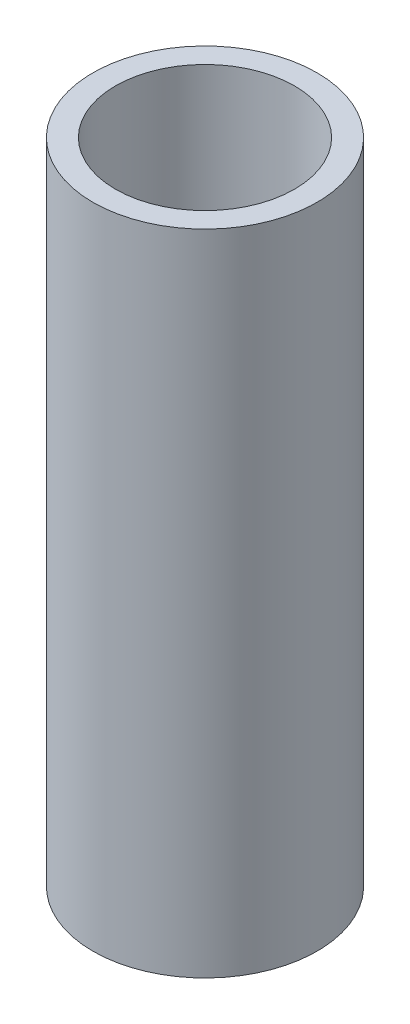
ISO-10303-21;
HEADER;
FILE_DESCRIPTION(('STEP AP214'),'2;1');
FILE_NAME('part.step','',(''),(''),'','','');
FILE_SCHEMA(('AUTOMOTIVE_DESIGN { 1 0 10303 214 1 1 1 1 }'));
ENDSEC;
DATA;
#1=APPLICATION_CONTEXT('core data for automotive mechanical design processes');
#2=APPLICATION_PROTOCOL_DEFINITION('international standard','automotive_design',2000,#1);
#3=PRODUCT_CONTEXT('',#1,'mechanical');
#4=PRODUCT('Part','Part','',(#3));
#5=PRODUCT_RELATED_PRODUCT_CATEGORY('part','',(#4));
#6=PRODUCT_DEFINITION_FORMATION('','',#4);
#7=PRODUCT_DEFINITION_CONTEXT('part definition',#1,'design');
#8=PRODUCT_DEFINITION('design','',#6,#7);
#9=PRODUCT_DEFINITION_SHAPE('','',#8);
#10=(LENGTH_UNIT() NAMED_UNIT(*) SI_UNIT(.MILLI.,.METRE.));
#11=(NAMED_UNIT(*) PLANE_ANGLE_UNIT() SI_UNIT($,.RADIAN.));
#12=(NAMED_UNIT(*) SI_UNIT($,.STERADIAN.) SOLID_ANGLE_UNIT());
#13=UNCERTAINTY_MEASURE_WITH_UNIT(LENGTH_MEASURE(1.E-05),#10,'distance_accuracy_value','');
#14=(GEOMETRIC_REPRESENTATION_CONTEXT(3) GLOBAL_UNCERTAINTY_ASSIGNED_CONTEXT((#13)) GLOBAL_UNIT_ASSIGNED_CONTEXT((#10,
#11,#12)) REPRESENTATION_CONTEXT('',''));
#15=CARTESIAN_POINT('',(0.,0.,0.));
#16=DIRECTION('',(0.,0.,1.));
#17=DIRECTION('',(1.,0.,0.));
#18=AXIS2_PLACEMENT_3D('',#15,#16,#17);
#19=CARTESIAN_POINT('',(0.,216.870746507421,0.));
#20=DIRECTION('',(0.,-1.,0.));
#21=DIRECTION('',(0.,0.,-1.));
#22=AXIS2_PLACEMENT_3D('',#19,#20,#21);
#23=CYLINDRICAL_SURFACE('',#22,37.5);
#24=CARTESIAN_POINT('',(0.,216.870746507421,0.));
#25=DIRECTION('',(0.,1.,0.));
#26=DIRECTION('',(0.,0.,1.));
#27=AXIS2_PLACEMENT_3D('',#24,#25,#26);
#28=CIRCLE('',#27,37.5);
#29=CARTESIAN_POINT('',(0.,216.870746507421,-37.5));
#30=VERTEX_POINT('',#29);
#31=EDGE_CURVE('E10',#30,#30,#28,.T.);
#32=CARTESIAN_POINT('',(0.,0.,0.));
#33=DIRECTION('',(0.,1.,0.));
#34=DIRECTION('',(0.,0.,1.));
#35=AXIS2_PLACEMENT_3D('',#32,#33,#34);
#36=CIRCLE('',#35,37.5);
#37=CARTESIAN_POINT('',(0.,0.,-37.5));
#38=VERTEX_POINT('',#37);
#39=EDGE_CURVE('E37',#38,#38,#36,.T.);
#40=CARTESIAN_POINT('',(0.,216.870746507421,-37.5));
#41=CARTESIAN_POINT('',(0.,214.611676231302,-37.5));
#42=CARTESIAN_POINT('',(0.,212.352605955183,-37.5));
#43=CARTESIAN_POINT('',(0.,207.834465402945,-37.5));
#44=CARTESIAN_POINT('',(0.,205.575395126826,-37.5));
#45=CARTESIAN_POINT('',(0.,201.057254574588,-37.5));
#46=CARTESIAN_POINT('',(0.,198.798184298469,-37.5));
#47=CARTESIAN_POINT('',(0.,194.280043746231,-37.5));
#48=CARTESIAN_POINT('',(0.,192.020973470112,-37.5));
#49=CARTESIAN_POINT('',(0.,187.502832917875,-37.5));
#50=CARTESIAN_POINT('',(0.,185.243762641756,-37.5));
#51=CARTESIAN_POINT('',(0.,180.725622089518,-37.5));
#52=CARTESIAN_POINT('',(0.,178.466551813399,-37.5));
#53=CARTESIAN_POINT('',(0.,173.948411261161,-37.5));
#54=CARTESIAN_POINT('',(0.,171.689340985042,-37.5));
#55=CARTESIAN_POINT('',(0.,167.171200432804,-37.5));
#56=CARTESIAN_POINT('',(0.,164.912130156685,-37.5));
#57=CARTESIAN_POINT('',(0.,160.393989604447,-37.5));
#58=CARTESIAN_POINT('',(0.,158.134919328328,-37.5));
#59=CARTESIAN_POINT('',(0.,153.61677877609,-37.5));
#60=CARTESIAN_POINT('',(0.,151.357708499971,-37.5));
#61=CARTESIAN_POINT('',(0.,146.839567947733,-37.5));
#62=CARTESIAN_POINT('',(0.,144.580497671614,-37.5));
#63=CARTESIAN_POINT('',(0.,140.062357119376,-37.5));
#64=CARTESIAN_POINT('',(0.,137.803286843257,-37.5));
#65=CARTESIAN_POINT('',(0.,133.285146291019,-37.5));
#66=CARTESIAN_POINT('',(0.,131.0260760149,-37.5));
#67=CARTESIAN_POINT('',(0.,126.507935462662,-37.5));
#68=CARTESIAN_POINT('',(0.,124.248865186543,-37.5));
#69=CARTESIAN_POINT('',(0.,119.730724634305,-37.5));
#70=CARTESIAN_POINT('',(0.,117.471654358186,-37.5));
#71=CARTESIAN_POINT('',(0.,112.953513805949,-37.5));
#72=CARTESIAN_POINT('',(0.,110.69444352983,-37.5));
#73=CARTESIAN_POINT('',(0.,106.176302977592,-37.5));
#74=CARTESIAN_POINT('',(0.,103.917232701473,-37.5));
#75=CARTESIAN_POINT('',(0.,99.3990921492347,-37.5));
#76=CARTESIAN_POINT('',(0.,97.1400218731157,-37.5));
#77=CARTESIAN_POINT('',(0.,92.6218813208778,-37.5));
#78=CARTESIAN_POINT('',(0.,90.3628110447588,-37.5));
#79=CARTESIAN_POINT('',(0.,85.8446704925209,-37.5));
#80=CARTESIAN_POINT('',(0.,83.5856002164019,-37.5));
#81=CARTESIAN_POINT('',(0.,79.067459664164,-37.5));
#82=CARTESIAN_POINT('',(0.,76.808389388045,-37.5));
#83=CARTESIAN_POINT('',(0.,72.290248835807,-37.5));
#84=CARTESIAN_POINT('',(0.,70.0311785596881,-37.5));
#85=CARTESIAN_POINT('',(0.,65.5130380074501,-37.5));
#86=CARTESIAN_POINT('',(0.,63.2539677313312,-37.5));
#87=CARTESIAN_POINT('',(0.,58.7358271790932,-37.5));
#88=CARTESIAN_POINT('',(0.,56.4767569029743,-37.5));
#89=CARTESIAN_POINT('',(0.,51.9586163507363,-37.5));
#90=CARTESIAN_POINT('',(0.,49.6995460746174,-37.5));
#91=CARTESIAN_POINT('',(0.,45.1814055223794,-37.5));
#92=CARTESIAN_POINT('',(0.,42.9223352462604,-37.5));
#93=CARTESIAN_POINT('',(0.,38.4041946940225,-37.5));
#94=CARTESIAN_POINT('',(0.,36.1451244179035,-37.5));
#95=CARTESIAN_POINT('',(0.,31.6269838656656,-37.5));
#96=CARTESIAN_POINT('',(0.,29.3679135895466,-37.5));
#97=CARTESIAN_POINT('',(0.,24.8497730373087,-37.5));
#98=CARTESIAN_POINT('',(0.,22.5907027611897,-37.5));
#99=CARTESIAN_POINT('',(0.,18.0725622089518,-37.5));
#100=CARTESIAN_POINT('',(0.,15.8134919328328,-37.5));
#101=CARTESIAN_POINT('',(0.,11.2953513805949,-37.5));
#102=CARTESIAN_POINT('',(0.,9.03628110447589,-37.5));
#103=CARTESIAN_POINT('',(0.,4.51814055223794,-37.5));
#104=CARTESIAN_POINT('',(0.,2.25907027611897,-37.5));
#105=CARTESIAN_POINT('',(0.,0.,-37.5));
#106=B_SPLINE_CURVE_WITH_KNOTS('',3,(#40,#41,#42,#43,#44,#45,#46,#47,#48,#49,#50,#51,#52,#53,
#54,#55,#56,#57,#58,#59,#60,#61,#62,#63,#64,#65,#66,#67,#68,#69,#70,#71,#72,#73,#74,#75,#76,#77,
#78,#79,#80,#81,#82,#83,#84,#85,#86,#87,#88,#89,#90,#91,#92,#93,#94,#95,#96,#97,#98,#99,#100,
#101,#102,#103,#104,#105),.UNSPECIFIED.,.F.,.F.,(4,2,2,2,2,2,2,2,2,2,2,2,2,2,2,2,2,2,2,2,2,2,2,
2,2,2,2,2,2,2,2,2,4),(0.,6.77721082835689,13.5544216567138,20.3316324850707,27.1088433134276,
33.8860541417845,40.6632649701414,47.4404757984984,54.2176866268553,60.9948974552122,
67.7721082835691,74.549319111926,81.3265299402829,88.1037407686398,94.8809515969968,
101.658162425354,108.435373253711,115.212584082067,121.989794910424,128.767005738781,
135.544216567138,142.321427395495,149.098638223852,155.875849052209,162.653059880566,
169.430270708923,176.20748153728,182.984692365637,189.761903193994,196.53911402235,
203.316324850707,210.093535679064,216.870746507421),.UNSPECIFIED.);
#107=EDGE_CURVE('BSEAM40',#30,#38,#106,.T.);
#108=ORIENTED_EDGE('',*,*,#31,.F.);
#109=ORIENTED_EDGE('',*,*,#39,.T.);
#110=ORIENTED_EDGE('',*,*,#107,.T.);
#111=ORIENTED_EDGE('',*,*,#107,.F.);
#112=EDGE_LOOP('',(#108,#110,#109,#111));
#113=FACE_BOUND('',#112,.T.);
#114=ADVANCED_FACE('F40',(#113),#23,.T.);
#115=CARTESIAN_POINT('',(0.,216.870746507421,0.));
#116=DIRECTION('',(0.,1.,0.));
#117=DIRECTION('',(0.,0.,1.));
#118=AXIS2_PLACEMENT_3D('',#115,#116,#117);
#119=PLANE('',#118);
#120=CARTESIAN_POINT('',(0.,216.870746507421,0.));
#121=DIRECTION('',(0.,1.,0.));
#122=DIRECTION('',(0.,0.,1.));
#123=AXIS2_PLACEMENT_3D('',#120,#121,#122);
#124=CIRCLE('',#123,29.9380110209311);
#125=CARTESIAN_POINT('',(0.,216.870746507421,-29.9380110209311));
#126=VERTEX_POINT('',#125);
#127=EDGE_CURVE('E50',#126,#126,#124,.T.);
#128=ORIENTED_EDGE('',*,*,#127,.F.);
#129=EDGE_LOOP('',(#128));
#130=FACE_BOUND('',#129,.T.);
#131=ORIENTED_EDGE('',*,*,#31,.T.);
#132=EDGE_LOOP('',(#131));
#133=FACE_BOUND('',#132,.T.);
#134=ADVANCED_FACE('F59',(#130,#133),#119,.T.);
#135=CARTESIAN_POINT('',(0.,0.,0.));
#136=DIRECTION('',(0.,1.,0.));
#137=DIRECTION('',(0.,0.,1.));
#138=AXIS2_PLACEMENT_3D('',#135,#136,#137);
#139=PLANE('',#138);
#140=CARTESIAN_POINT('',(0.,0.,0.));
#141=DIRECTION('',(0.,1.,0.));
#142=DIRECTION('',(0.,0.,1.));
#143=AXIS2_PLACEMENT_3D('',#140,#141,#142);
#144=CIRCLE('',#143,29.9380110209311);
#145=CARTESIAN_POINT('',(0.,0.,-29.9380110209311));
#146=VERTEX_POINT('',#145);
#147=EDGE_CURVE('E47',#146,#146,#144,.T.);
#148=ORIENTED_EDGE('',*,*,#147,.T.);
#149=EDGE_LOOP('',(#148));
#150=FACE_BOUND('',#149,.T.);
#151=ORIENTED_EDGE('',*,*,#39,.F.);
#152=EDGE_LOOP('',(#151));
#153=FACE_BOUND('',#152,.T.);
#154=ADVANCED_FACE('F58',(#150,#153),#139,.F.);
#155=CARTESIAN_POINT('',(0.,216.870746507421,0.));
#156=DIRECTION('',(0.,-1.,0.));
#157=DIRECTION('',(0.,0.,-1.));
#158=AXIS2_PLACEMENT_3D('',#155,#156,#157);
#159=CYLINDRICAL_SURFACE('',#158,29.9380110209311);
#160=CARTESIAN_POINT('',(0.,216.870746507421,-29.9380110209311));
#161=CARTESIAN_POINT('',(0.,214.611676231302,-29.9380110209311));
#162=CARTESIAN_POINT('',(0.,212.352605955183,-29.9380110209311));
#163=CARTESIAN_POINT('',(0.,207.834465402945,-29.9380110209311));
#164=CARTESIAN_POINT('',(0.,205.575395126826,-29.9380110209311));
#165=CARTESIAN_POINT('',(0.,201.057254574588,-29.9380110209311));
#166=CARTESIAN_POINT('',(0.,198.798184298469,-29.9380110209311));
#167=CARTESIAN_POINT('',(0.,194.280043746231,-29.9380110209311));
#168=CARTESIAN_POINT('',(0.,192.020973470112,-29.9380110209311));
#169=CARTESIAN_POINT('',(0.,187.502832917875,-29.9380110209311));
#170=CARTESIAN_POINT('',(0.,185.243762641756,-29.9380110209311));
#171=CARTESIAN_POINT('',(0.,180.725622089518,-29.9380110209311));
#172=CARTESIAN_POINT('',(0.,178.466551813399,-29.9380110209311));
#173=CARTESIAN_POINT('',(0.,173.948411261161,-29.9380110209311));
#174=CARTESIAN_POINT('',(0.,171.689340985042,-29.9380110209311));
#175=CARTESIAN_POINT('',(0.,167.171200432804,-29.9380110209311));
#176=CARTESIAN_POINT('',(0.,164.912130156685,-29.9380110209311));
#177=CARTESIAN_POINT('',(0.,160.393989604447,-29.9380110209311));
#178=CARTESIAN_POINT('',(0.,158.134919328328,-29.9380110209311));
#179=CARTESIAN_POINT('',(0.,153.61677877609,-29.9380110209311));
#180=CARTESIAN_POINT('',(0.,151.357708499971,-29.9380110209311));
#181=CARTESIAN_POINT('',(0.,146.839567947733,-29.9380110209311));
#182=CARTESIAN_POINT('',(0.,144.580497671614,-29.9380110209311));
#183=CARTESIAN_POINT('',(0.,140.062357119376,-29.9380110209311));
#184=CARTESIAN_POINT('',(0.,137.803286843257,-29.9380110209311));
#185=CARTESIAN_POINT('',(0.,133.285146291019,-29.9380110209311));
#186=CARTESIAN_POINT('',(0.,131.0260760149,-29.9380110209311));
#187=CARTESIAN_POINT('',(0.,126.507935462662,-29.9380110209311));
#188=CARTESIAN_POINT('',(0.,124.248865186543,-29.9380110209311));
#189=CARTESIAN_POINT('',(0.,119.730724634305,-29.9380110209311));
#190=CARTESIAN_POINT('',(0.,117.471654358186,-29.9380110209311));
#191=CARTESIAN_POINT('',(0.,112.953513805949,-29.9380110209311));
#192=CARTESIAN_POINT('',(0.,110.69444352983,-29.9380110209311));
#193=CARTESIAN_POINT('',(0.,106.176302977592,-29.9380110209311));
#194=CARTESIAN_POINT('',(0.,103.917232701473,-29.9380110209311));
#195=CARTESIAN_POINT('',(0.,99.3990921492347,-29.9380110209311));
#196=CARTESIAN_POINT('',(0.,97.1400218731157,-29.9380110209311));
#197=CARTESIAN_POINT('',(0.,92.6218813208778,-29.9380110209311));
#198=CARTESIAN_POINT('',(0.,90.3628110447588,-29.9380110209311));
#199=CARTESIAN_POINT('',(0.,85.8446704925209,-29.9380110209311));
#200=CARTESIAN_POINT('',(0.,83.5856002164019,-29.9380110209311));
#201=CARTESIAN_POINT('',(0.,79.067459664164,-29.9380110209311));
#202=CARTESIAN_POINT('',(0.,76.808389388045,-29.9380110209311));
#203=CARTESIAN_POINT('',(0.,72.2902488358071,-29.9380110209311));
#204=CARTESIAN_POINT('',(0.,70.0311785596881,-29.9380110209311));
#205=CARTESIAN_POINT('',(0.,65.5130380074502,-29.9380110209311));
#206=CARTESIAN_POINT('',(0.,63.2539677313312,-29.9380110209311));
#207=CARTESIAN_POINT('',(0.,58.7358271790932,-29.9380110209311));
#208=CARTESIAN_POINT('',(0.,56.4767569029743,-29.9380110209311));
#209=CARTESIAN_POINT('',(0.,51.9586163507363,-29.9380110209311));
#210=CARTESIAN_POINT('',(0.,49.6995460746174,-29.9380110209311));
#211=CARTESIAN_POINT('',(0.,45.1814055223794,-29.9380110209311));
#212=CARTESIAN_POINT('',(0.,42.9223352462604,-29.9380110209311));
#213=CARTESIAN_POINT('',(0.,38.4041946940225,-29.9380110209311));
#214=CARTESIAN_POINT('',(0.,36.1451244179035,-29.9380110209311));
#215=CARTESIAN_POINT('',(0.,31.6269838656656,-29.9380110209311));
#216=CARTESIAN_POINT('',(0.,29.3679135895466,-29.9380110209311));
#217=CARTESIAN_POINT('',(0.,24.8497730373087,-29.9380110209311));
#218=CARTESIAN_POINT('',(0.,22.5907027611897,-29.9380110209311));
#219=CARTESIAN_POINT('',(0.,18.0725622089518,-29.9380110209311));
#220=CARTESIAN_POINT('',(0.,15.8134919328328,-29.9380110209311));
#221=CARTESIAN_POINT('',(0.,11.2953513805949,-29.9380110209311));
#222=CARTESIAN_POINT('',(0.,9.03628110447589,-29.9380110209311));
#223=CARTESIAN_POINT('',(0.,4.51814055223794,-29.9380110209311));
#224=CARTESIAN_POINT('',(0.,2.25907027611897,-29.9380110209311));
#225=CARTESIAN_POINT('',(0.,0.,-29.9380110209311));
#226=B_SPLINE_CURVE_WITH_KNOTS('',3,(#160,#161,#162,#163,#164,#165,#166,#167,#168,#169,#170,
#171,#172,#173,#174,#175,#176,#177,#178,#179,#180,#181,#182,#183,#184,#185,#186,#187,#188,#189,
#190,#191,#192,#193,#194,#195,#196,#197,#198,#199,#200,#201,#202,#203,#204,#205,#206,#207,#208,
#209,#210,#211,#212,#213,#214,#215,#216,#217,#218,#219,#220,#221,#222,#223,#224,#225),
.UNSPECIFIED.,.F.,.F.,(4,2,2,2,2,2,2,2,2,2,2,2,2,2,2,2,2,2,2,2,2,2,2,2,2,2,2,2,2,2,2,2,4),(0.,
6.77721082835692,13.5544216567138,20.3316324850707,27.1088433134277,33.8860541417846,
40.6632649701415,47.4404757984984,54.2176866268553,60.9948974552122,67.7721082835691,
74.5493191119261,81.326529940283,88.1037407686399,94.8809515969968,101.658162425354,
108.435373253711,115.212584082068,121.989794910424,128.767005738781,135.544216567138,
142.321427395495,149.098638223852,155.875849052209,162.653059880566,169.430270708923,
176.20748153728,182.984692365637,189.761903193994,196.53911402235,203.316324850707,
210.093535679064,216.870746507421),.UNSPECIFIED.);
#227=EDGE_CURVE('BSEAM54',#126,#146,#226,.T.);
#228=ORIENTED_EDGE('',*,*,#127,.T.);
#229=ORIENTED_EDGE('',*,*,#147,.F.);
#230=ORIENTED_EDGE('',*,*,#227,.T.);
#231=ORIENTED_EDGE('',*,*,#227,.F.);
#232=EDGE_LOOP('',(#228,#230,#229,#231));
#233=FACE_BOUND('',#232,.T.);
#234=ADVANCED_FACE('F54',(#233),#159,.F.);
#235=CLOSED_SHELL('',(#114,#134,#154,#234));
#236=MANIFOLD_SOLID_BREP('B2',#235);
#237=ADVANCED_BREP_SHAPE_REPRESENTATION('',(#18,#236),#14);
#238=SHAPE_DEFINITION_REPRESENTATION(#9,#237);
ENDSEC;
END-ISO-10303-21;
